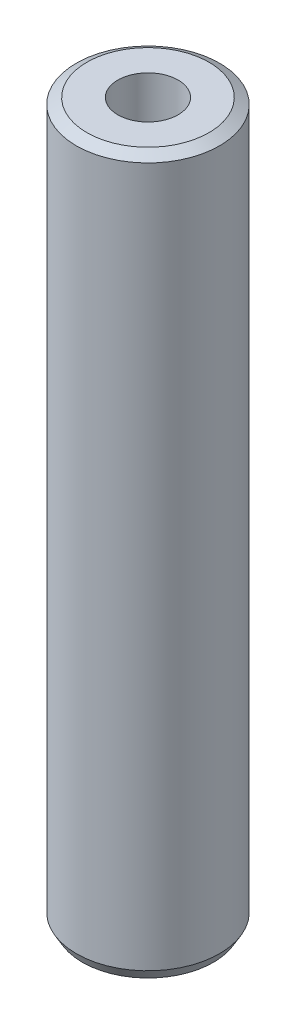
ISO-10303-21;
HEADER;
FILE_DESCRIPTION(('STEP AP214'),'2;1');
FILE_NAME('part.step','',(''),(''),'','','');
FILE_SCHEMA(('AUTOMOTIVE_DESIGN { 1 0 10303 214 1 1 1 1 }'));
ENDSEC;
DATA;
#1=APPLICATION_CONTEXT('core data for automotive mechanical design processes');
#2=APPLICATION_PROTOCOL_DEFINITION('international standard','automotive_design',2000,#1);
#3=PRODUCT_CONTEXT('',#1,'mechanical');
#4=PRODUCT('Part','Part','',(#3));
#5=PRODUCT_RELATED_PRODUCT_CATEGORY('part','',(#4));
#6=PRODUCT_DEFINITION_FORMATION('','',#4);
#7=PRODUCT_DEFINITION_CONTEXT('part definition',#1,'design');
#8=PRODUCT_DEFINITION('design','',#6,#7);
#9=PRODUCT_DEFINITION_SHAPE('','',#8);
#10=(LENGTH_UNIT() NAMED_UNIT(*) SI_UNIT(.MILLI.,.METRE.));
#11=(NAMED_UNIT(*) PLANE_ANGLE_UNIT() SI_UNIT($,.RADIAN.));
#12=(NAMED_UNIT(*) SI_UNIT($,.STERADIAN.) SOLID_ANGLE_UNIT());
#13=UNCERTAINTY_MEASURE_WITH_UNIT(LENGTH_MEASURE(1.E-05),#10,'distance_accuracy_value','');
#14=(GEOMETRIC_REPRESENTATION_CONTEXT(3) GLOBAL_UNCERTAINTY_ASSIGNED_CONTEXT((#13)) GLOBAL_UNIT_ASSIGNED_CONTEXT((#10,
#11,#12)) REPRESENTATION_CONTEXT('',''));
#15=CARTESIAN_POINT('',(0.,0.,0.));
#16=DIRECTION('',(0.,0.,1.));
#17=DIRECTION('',(1.,0.,0.));
#18=AXIS2_PLACEMENT_3D('',#15,#16,#17);
#19=CARTESIAN_POINT('',(0.,600.,0.));
#20=DIRECTION('',(0.,-1.,0.));
#21=DIRECTION('',(0.,0.,-1.));
#22=AXIS2_PLACEMENT_3D('',#19,#20,#21);
#23=CYLINDRICAL_SURFACE('',#22,60.);
#24=CARTESIAN_POINT('',(0.,594.882370808217,0.));
#25=DIRECTION('',(0.,1.,0.));
#26=DIRECTION('',(0.,0.,1.));
#27=AXIS2_PLACEMENT_3D('',#24,#25,#26);
#28=CIRCLE('',#27,60.);
#29=CARTESIAN_POINT('',(0.,594.882370808217,60.));
#30=VERTEX_POINT('',#29);
#31=EDGE_CURVE('E50',#30,#30,#28,.F.);
#32=ORIENTED_EDGE('',*,*,#31,.T.);
#33=EDGE_LOOP('',(#32));
#34=FACE_BOUND('',#33,.T.);
#35=CARTESIAN_POINT('',(0.,8.86399377446545,0.));
#36=DIRECTION('',(0.,1.,0.));
#37=DIRECTION('',(0.,0.,1.));
#38=AXIS2_PLACEMENT_3D('',#35,#36,#37);
#39=CIRCLE('',#38,60.);
#40=CARTESIAN_POINT('',(0.,8.86399377446545,60.));
#41=VERTEX_POINT('',#40);
#42=EDGE_CURVE('E51',#41,#41,#39,.T.);
#43=ORIENTED_EDGE('',*,*,#42,.T.);
#44=EDGE_LOOP('',(#43));
#45=FACE_BOUND('',#44,.T.);
#46=ADVANCED_FACE('F39',(#34,#45),#23,.T.);
#47=CARTESIAN_POINT('',(0.,600.,0.));
#48=DIRECTION('',(0.,1.,0.));
#49=DIRECTION('',(0.,0.,1.));
#50=AXIS2_PLACEMENT_3D('',#47,#48,#49);
#51=PLANE('',#50);
#52=CARTESIAN_POINT('',(0.,600.,0.));
#53=DIRECTION('',(0.,1.,0.));
#54=DIRECTION('',(0.,0.,1.));
#55=AXIS2_PLACEMENT_3D('',#52,#53,#54);
#56=CIRCLE('',#55,51.1360062255344);
#57=CARTESIAN_POINT('',(0.,600.,51.1360062255344));
#58=VERTEX_POINT('',#57);
#59=EDGE_CURVE('E54',#58,#58,#56,.T.);
#60=ORIENTED_EDGE('',*,*,#59,.T.);
#61=EDGE_LOOP('',(#60));
#62=FACE_BOUND('',#61,.T.);
#63=CARTESIAN_POINT('',(0.,600.,0.));
#64=DIRECTION('',(0.,1.,0.));
#65=DIRECTION('',(0.,0.,1.));
#66=AXIS2_PLACEMENT_3D('',#63,#64,#65);
#67=CIRCLE('',#66,25.2598323914343);
#68=CARTESIAN_POINT('',(0.,600.,25.2598323914343));
#69=VERTEX_POINT('',#68);
#70=EDGE_CURVE('E58',#69,#69,#67,.T.);
#71=ORIENTED_EDGE('',*,*,#70,.F.);
#72=EDGE_LOOP('',(#71));
#73=FACE_BOUND('',#72,.T.);
#74=ADVANCED_FACE('F69',(#62,#73),#51,.T.);
#75=CARTESIAN_POINT('',(0.,0.,0.));
#76=DIRECTION('',(0.,1.,0.));
#77=DIRECTION('',(0.,0.,1.));
#78=AXIS2_PLACEMENT_3D('',#75,#76,#77);
#79=PLANE('',#78);
#80=CARTESIAN_POINT('',(0.,0.,0.));
#81=DIRECTION('',(0.,1.,0.));
#82=DIRECTION('',(0.,0.,1.));
#83=AXIS2_PLACEMENT_3D('',#80,#81,#82);
#84=CIRCLE('',#83,54.8823708082171);
#85=CARTESIAN_POINT('',(0.,0.,54.8823708082171));
#86=VERTEX_POINT('',#85);
#87=EDGE_CURVE('E10',#86,#86,#84,.F.);
#88=ORIENTED_EDGE('',*,*,#87,.T.);
#89=EDGE_LOOP('',(#88));
#90=FACE_BOUND('',#89,.T.);
#91=CARTESIAN_POINT('',(0.,0.,0.));
#92=DIRECTION('',(0.,1.,0.));
#93=DIRECTION('',(0.,0.,1.));
#94=AXIS2_PLACEMENT_3D('',#91,#92,#93);
#95=CIRCLE('',#94,25.2598323914343);
#96=CARTESIAN_POINT('',(0.,0.,25.2598323914343));
#97=VERTEX_POINT('',#96);
#98=EDGE_CURVE('E63',#97,#97,#95,.T.);
#99=ORIENTED_EDGE('',*,*,#98,.T.);
#100=EDGE_LOOP('',(#99));
#101=FACE_BOUND('',#100,.T.);
#102=ADVANCED_FACE('F75',(#90,#101),#79,.F.);
#103=CARTESIAN_POINT('',(0.,600.,0.));
#104=DIRECTION('',(0.,-1.,0.));
#105=DIRECTION('',(0.,0.,-1.));
#106=AXIS2_PLACEMENT_3D('',#103,#104,#105);
#107=CYLINDRICAL_SURFACE('',#106,25.2598323914343);
#108=ORIENTED_EDGE('',*,*,#70,.T.);
#109=EDGE_LOOP('',(#108));
#110=FACE_BOUND('',#109,.T.);
#111=ORIENTED_EDGE('',*,*,#98,.F.);
#112=EDGE_LOOP('',(#111));
#113=FACE_BOUND('',#112,.T.);
#114=ADVANCED_FACE('F70',(#110,#113),#107,.F.);
#115=CARTESIAN_POINT('',(0.,600.,0.));
#116=DIRECTION('',(0.,-1.,0.));
#117=DIRECTION('',(0.,0.,-1.));
#118=AXIS2_PLACEMENT_3D('',#115,#116,#117);
#119=CONICAL_SURFACE('',#118,51.1360062255344,1.04719755119658);
#120=ORIENTED_EDGE('',*,*,#31,.F.);
#121=EDGE_LOOP('',(#120));
#122=FACE_BOUND('',#121,.T.);
#123=ORIENTED_EDGE('',*,*,#59,.F.);
#124=EDGE_LOOP('',(#123));
#125=FACE_BOUND('',#124,.T.);
#126=ADVANCED_FACE('F81',(#122,#125),#119,.T.);
#127=CARTESIAN_POINT('',(0.,8.86399377446545,0.));
#128=DIRECTION('',(0.,1.,0.));
#129=DIRECTION('',(0.,0.,1.));
#130=AXIS2_PLACEMENT_3D('',#127,#128,#129);
#131=CONICAL_SURFACE('',#130,60.,0.523598775598306);
#132=ORIENTED_EDGE('',*,*,#87,.F.);
#133=EDGE_LOOP('',(#132));
#134=FACE_BOUND('',#133,.T.);
#135=ORIENTED_EDGE('',*,*,#42,.F.);
#136=EDGE_LOOP('',(#135));
#137=FACE_BOUND('',#136,.T.);
#138=ADVANCED_FACE('F45',(#134,#137),#131,.T.);
#139=CLOSED_SHELL('',(#46,#74,#102,#114,#126,#138));
#140=MANIFOLD_SOLID_BREP('B2',#139);
#141=ADVANCED_BREP_SHAPE_REPRESENTATION('',(#18,#140),#14);
#142=SHAPE_DEFINITION_REPRESENTATION(#9,#141);
ENDSEC;
END-ISO-10303-21;
